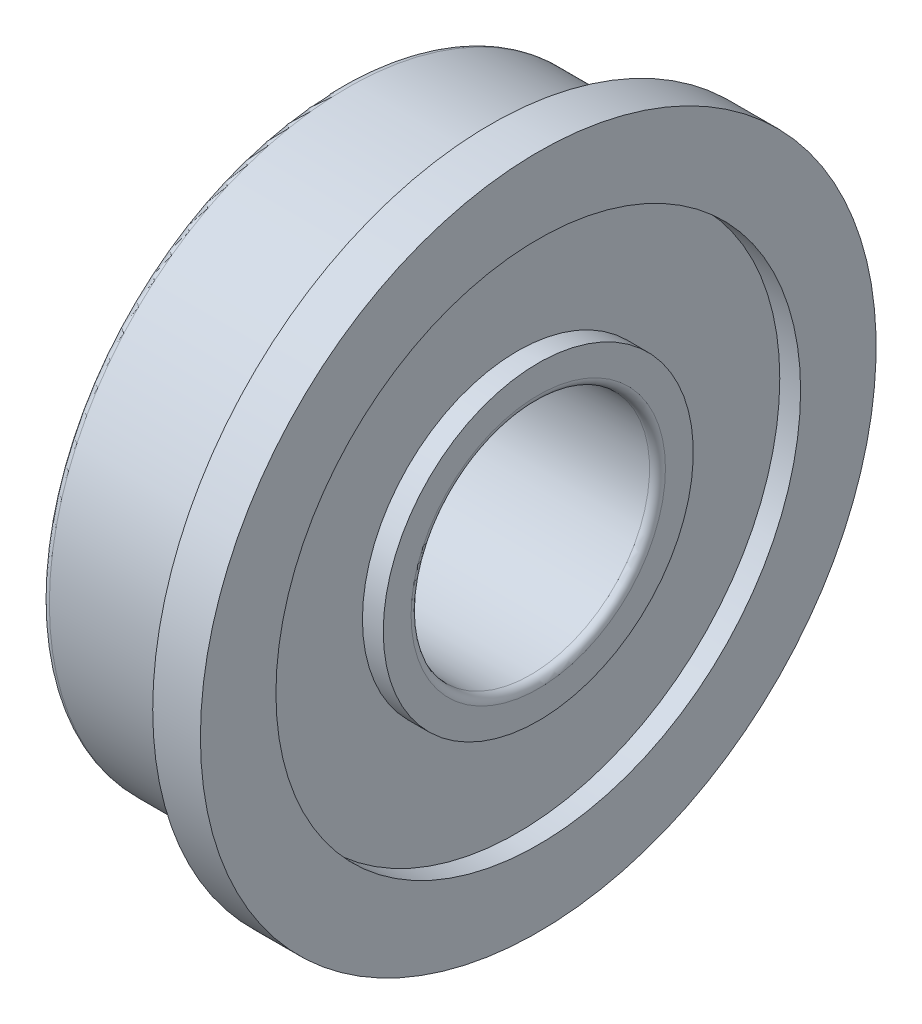
ISO-10303-21;
HEADER;
FILE_DESCRIPTION(('STEP AP214'),'2;1');
FILE_NAME('part.step','',(''),(''),'','','');
FILE_SCHEMA(('AUTOMOTIVE_DESIGN { 1 0 10303 214 1 1 1 1 }'));
ENDSEC;
DATA;
#1=APPLICATION_CONTEXT('core data for automotive mechanical design processes');
#2=APPLICATION_PROTOCOL_DEFINITION('international standard','automotive_design',2000,#1);
#3=PRODUCT_CONTEXT('',#1,'mechanical');
#4=PRODUCT('Part','Part','',(#3));
#5=PRODUCT_RELATED_PRODUCT_CATEGORY('part','',(#4));
#6=PRODUCT_DEFINITION_FORMATION('','',#4);
#7=PRODUCT_DEFINITION_CONTEXT('part definition',#1,'design');
#8=PRODUCT_DEFINITION('design','',#6,#7);
#9=PRODUCT_DEFINITION_SHAPE('','',#8);
#10=(LENGTH_UNIT() NAMED_UNIT(*) SI_UNIT(.MILLI.,.METRE.));
#11=(NAMED_UNIT(*) PLANE_ANGLE_UNIT() SI_UNIT($,.RADIAN.));
#12=(NAMED_UNIT(*) SI_UNIT($,.STERADIAN.) SOLID_ANGLE_UNIT());
#13=UNCERTAINTY_MEASURE_WITH_UNIT(LENGTH_MEASURE(1.E-05),#10,'distance_accuracy_value','');
#14=(GEOMETRIC_REPRESENTATION_CONTEXT(3) GLOBAL_UNCERTAINTY_ASSIGNED_CONTEXT((#13)) GLOBAL_UNIT_ASSIGNED_CONTEXT((#10,
#11,#12)) REPRESENTATION_CONTEXT('',''));
#15=CARTESIAN_POINT('',(0.,0.,0.));
#16=DIRECTION('',(0.,0.,1.));
#17=DIRECTION('',(1.,0.,0.));
#18=AXIS2_PLACEMENT_3D('',#15,#16,#17);
#19=CARTESIAN_POINT('',(0.,-3.90000000000003,-3.90000000000001));
#20=DIRECTION('',(-1.,0.,0.));
#21=DIRECTION('',(0.,0.,1.));
#22=AXIS2_PLACEMENT_3D('',#19,#20,#21);
#23=PLANE('',#22);
#24=CARTESIAN_POINT('',(0.,0.,0.));
#25=DIRECTION('',(-1.,0.,0.));
#26=DIRECTION('',(0.,0.,-1.));
#27=AXIS2_PLACEMENT_3D('',#24,#25,#26);
#28=CIRCLE('',#27,3.9);
#29=CARTESIAN_POINT('',(0.,0.,-3.9));
#30=VERTEX_POINT('',#29);
#31=EDGE_CURVE('E74',#30,#30,#28,.F.);
#32=ORIENTED_EDGE('',*,*,#31,.F.);
#33=EDGE_LOOP('',(#32));
#34=FACE_BOUND('',#33,.T.);
#35=CARTESIAN_POINT('',(0.,0.,0.));
#36=DIRECTION('',(1.,0.,0.));
#37=DIRECTION('',(0.,0.,1.));
#38=AXIS2_PLACEMENT_3D('',#35,#36,#37);
#39=CIRCLE('',#38,3.2);
#40=CARTESIAN_POINT('',(0.,0.,3.2));
#41=VERTEX_POINT('',#40);
#42=EDGE_CURVE('E71',#41,#41,#39,.T.);
#43=ORIENTED_EDGE('',*,*,#42,.T.);
#44=EDGE_LOOP('',(#43));
#45=FACE_BOUND('',#44,.T.);
#46=ADVANCED_FACE('F15',(#34,#45),#23,.T.);
#47=CARTESIAN_POINT('',(5.,-3.9,3.9));
#48=DIRECTION('',(1.,0.,0.));
#49=DIRECTION('',(0.,0.,-1.));
#50=AXIS2_PLACEMENT_3D('',#47,#48,#49);
#51=PLANE('',#50);
#52=CARTESIAN_POINT('',(5.,0.,0.));
#53=DIRECTION('',(1.,0.,0.));
#54=DIRECTION('',(0.,0.,1.));
#55=AXIS2_PLACEMENT_3D('',#52,#53,#54);
#56=CIRCLE('',#55,3.9);
#57=CARTESIAN_POINT('',(5.,0.,3.9));
#58=VERTEX_POINT('',#57);
#59=EDGE_CURVE('E68',#58,#58,#56,.T.);
#60=ORIENTED_EDGE('',*,*,#59,.T.);
#61=EDGE_LOOP('',(#60));
#62=FACE_BOUND('',#61,.T.);
#63=CARTESIAN_POINT('',(5.,0.,0.));
#64=DIRECTION('',(-1.,0.,0.));
#65=DIRECTION('',(0.,0.,-1.));
#66=AXIS2_PLACEMENT_3D('',#63,#64,#65);
#67=CIRCLE('',#66,3.2000001119473);
#68=CARTESIAN_POINT('',(5.,0.,-3.2000001119473));
#69=VERTEX_POINT('',#68);
#70=EDGE_CURVE('E65',#69,#69,#67,.F.);
#71=ORIENTED_EDGE('',*,*,#70,.F.);
#72=EDGE_LOOP('',(#71));
#73=FACE_BOUND('',#72,.T.);
#74=ADVANCED_FACE('F82',(#62,#73),#51,.T.);
#75=CARTESIAN_POINT('',(4.47625,-6.78033812054813,6.6));
#76=DIRECTION('',(1.,0.,0.));
#77=DIRECTION('',(0.,0.,-1.));
#78=AXIS2_PLACEMENT_3D('',#75,#76,#77);
#79=PLANE('',#78);
#80=CARTESIAN_POINT('',(4.47625,0.,0.));
#81=DIRECTION('',(1.,0.,0.));
#82=DIRECTION('',(0.,0.,1.));
#83=AXIS2_PLACEMENT_3D('',#80,#81,#82);
#84=CIRCLE('',#83,6.6);
#85=CARTESIAN_POINT('',(4.47625,0.,6.6));
#86=VERTEX_POINT('',#85);
#87=EDGE_CURVE('E62',#86,#86,#84,.T.);
#88=ORIENTED_EDGE('',*,*,#87,.T.);
#89=EDGE_LOOP('',(#88));
#90=FACE_BOUND('',#89,.T.);
#91=CARTESIAN_POINT('',(4.47625,0.,0.));
#92=DIRECTION('',(-1.,0.,0.));
#93=DIRECTION('',(0.,0.,-1.));
#94=AXIS2_PLACEMENT_3D('',#91,#92,#93);
#95=CIRCLE('',#94,3.9);
#96=CARTESIAN_POINT('',(4.47625,0.,-3.9));
#97=VERTEX_POINT('',#96);
#98=EDGE_CURVE('E59',#97,#97,#95,.F.);
#99=ORIENTED_EDGE('',*,*,#98,.F.);
#100=EDGE_LOOP('',(#99));
#101=FACE_BOUND('',#100,.T.);
#102=ADVANCED_FACE('F153',(#90,#101),#79,.T.);
#103=CARTESIAN_POINT('',(5.,-8.73225362560405,8.5));
#104=DIRECTION('',(1.,0.,0.));
#105=DIRECTION('',(0.,0.,-1.));
#106=AXIS2_PLACEMENT_3D('',#103,#104,#105);
#107=PLANE('',#106);
#108=CARTESIAN_POINT('',(5.,0.,0.));
#109=DIRECTION('',(1.,0.,0.));
#110=DIRECTION('',(0.,-1.16842149027969E-09,1.));
#111=AXIS2_PLACEMENT_3D('',#108,#109,#110);
#112=CIRCLE('',#111,8.5);
#113=CARTESIAN_POINT('',(5.,-9.93158266737737E-09,8.5));
#114=VERTEX_POINT('',#113);
#115=EDGE_CURVE('E56',#114,#114,#112,.T.);
#116=ORIENTED_EDGE('',*,*,#115,.T.);
#117=EDGE_LOOP('',(#116));
#118=FACE_BOUND('',#117,.T.);
#119=CARTESIAN_POINT('',(5.,0.,0.));
#120=DIRECTION('',(-1.,0.,0.));
#121=DIRECTION('',(0.,0.,-1.));
#122=AXIS2_PLACEMENT_3D('',#119,#120,#121);
#123=CIRCLE('',#122,6.6);
#124=CARTESIAN_POINT('',(5.,0.,-6.6));
#125=VERTEX_POINT('',#124);
#126=EDGE_CURVE('E53',#125,#125,#123,.F.);
#127=ORIENTED_EDGE('',*,*,#126,.F.);
#128=EDGE_LOOP('',(#127));
#129=FACE_BOUND('',#128,.T.);
#130=ADVANCED_FACE('F146',(#118,#129),#107,.T.);
#131=CARTESIAN_POINT('',(3.8,-8.73225364009987,-8.5));
#132=DIRECTION('',(-1.,0.,0.));
#133=DIRECTION('',(0.,0.,1.));
#134=AXIS2_PLACEMENT_3D('',#131,#132,#133);
#135=PLANE('',#134);
#136=CARTESIAN_POINT('',(3.8,0.,0.));
#137=DIRECTION('',(-1.,0.,0.));
#138=DIRECTION('',(0.,0.,-1.));
#139=AXIS2_PLACEMENT_3D('',#136,#137,#138);
#140=CIRCLE('',#139,8.5);
#141=CARTESIAN_POINT('',(3.8,0.,-8.5));
#142=VERTEX_POINT('',#141);
#143=EDGE_CURVE('E50',#142,#142,#140,.F.);
#144=ORIENTED_EDGE('',*,*,#143,.F.);
#145=EDGE_LOOP('',(#144));
#146=FACE_BOUND('',#145,.T.);
#147=CARTESIAN_POINT('',(3.8,0.,0.));
#148=DIRECTION('',(1.,0.,0.));
#149=DIRECTION('',(0.,0.,1.));
#150=AXIS2_PLACEMENT_3D('',#147,#148,#149);
#151=CIRCLE('',#150,7.7);
#152=CARTESIAN_POINT('',(3.8,0.,7.7));
#153=VERTEX_POINT('',#152);
#154=EDGE_CURVE('E47',#153,#153,#151,.T.);
#155=ORIENTED_EDGE('',*,*,#154,.T.);
#156=EDGE_LOOP('',(#155));
#157=FACE_BOUND('',#156,.T.);
#158=ADVANCED_FACE('F141',(#146,#157),#135,.T.);
#159=CARTESIAN_POINT('',(0.,-7.4994648909093,-7.3));
#160=DIRECTION('',(-1.,0.,0.));
#161=DIRECTION('',(0.,0.,1.));
#162=AXIS2_PLACEMENT_3D('',#159,#160,#161);
#163=PLANE('',#162);
#164=CARTESIAN_POINT('',(0.,0.,0.));
#165=DIRECTION('',(-1.,0.,0.));
#166=DIRECTION('',(0.,0.,-1.));
#167=AXIS2_PLACEMENT_3D('',#164,#165,#166);
#168=CIRCLE('',#167,7.3);
#169=CARTESIAN_POINT('',(0.,0.,-7.3));
#170=VERTEX_POINT('',#169);
#171=EDGE_CURVE('E44',#170,#170,#168,.F.);
#172=ORIENTED_EDGE('',*,*,#171,.F.);
#173=EDGE_LOOP('',(#172));
#174=FACE_BOUND('',#173,.T.);
#175=CARTESIAN_POINT('',(0.,0.,0.));
#176=DIRECTION('',(1.,0.,0.));
#177=DIRECTION('',(0.,0.,1.));
#178=AXIS2_PLACEMENT_3D('',#175,#176,#177);
#179=CIRCLE('',#178,6.6);
#180=CARTESIAN_POINT('',(0.,0.,6.6));
#181=VERTEX_POINT('',#180);
#182=EDGE_CURVE('E41',#181,#181,#179,.T.);
#183=ORIENTED_EDGE('',*,*,#182,.T.);
#184=EDGE_LOOP('',(#183));
#185=FACE_BOUND('',#184,.T.);
#186=ADVANCED_FACE('F100',(#174,#185),#163,.T.);
#187=CARTESIAN_POINT('',(0.52375,-6.78033812054813,-6.6));
#188=DIRECTION('',(-1.,0.,0.));
#189=DIRECTION('',(0.,0.,1.));
#190=AXIS2_PLACEMENT_3D('',#187,#188,#189);
#191=PLANE('',#190);
#192=CARTESIAN_POINT('',(0.52375,0.,0.));
#193=DIRECTION('',(-1.,0.,0.));
#194=DIRECTION('',(0.,0.,-1.));
#195=AXIS2_PLACEMENT_3D('',#192,#193,#194);
#196=CIRCLE('',#195,6.6);
#197=CARTESIAN_POINT('',(0.52375,0.,-6.6));
#198=VERTEX_POINT('',#197);
#199=EDGE_CURVE('E38',#198,#198,#196,.F.);
#200=ORIENTED_EDGE('',*,*,#199,.F.);
#201=EDGE_LOOP('',(#200));
#202=FACE_BOUND('',#201,.T.);
#203=CARTESIAN_POINT('',(0.52375,0.,0.));
#204=DIRECTION('',(1.,0.,0.));
#205=DIRECTION('',(0.,-1.42053902544095E-07,0.99999999999999));
#206=AXIS2_PLACEMENT_3D('',#203,#204,#205);
#207=CIRCLE('',#206,3.9);
#208=CARTESIAN_POINT('',(0.52375,-5.54010219921971E-07,3.89999999999996));
#209=VERTEX_POINT('',#208);
#210=EDGE_CURVE('E35',#209,#209,#207,.T.);
#211=ORIENTED_EDGE('',*,*,#210,.T.);
#212=EDGE_LOOP('',(#211));
#213=FACE_BOUND('',#212,.T.);
#214=ADVANCED_FACE('F89',(#202,#213),#191,.T.);
#215=CARTESIAN_POINT('',(0.200000000000016,0.,0.));
#216=DIRECTION('',(1.,0.,0.));
#217=DIRECTION('',(0.,0.,1.));
#218=AXIS2_PLACEMENT_3D('',#215,#216,#217);
#219=TOROIDAL_SURFACE('',#218,3.2,0.200000000000016);
#220=CARTESIAN_POINT('',(0.2,0.,0.));
#221=DIRECTION('',(1.,0.,0.));
#222=DIRECTION('',(0.,0.,1.));
#223=AXIS2_PLACEMENT_3D('',#220,#221,#222);
#224=CIRCLE('',#223,2.99999999999998);
#225=CARTESIAN_POINT('',(0.2,0.,2.99999999999998));
#226=VERTEX_POINT('',#225);
#227=EDGE_CURVE('E30',#226,#226,#224,.T.);
#228=ORIENTED_EDGE('',*,*,#227,.T.);
#229=EDGE_LOOP('',(#228));
#230=FACE_BOUND('',#229,.T.);
#231=ORIENTED_EDGE('',*,*,#42,.F.);
#232=EDGE_LOOP('',(#231));
#233=FACE_BOUND('',#232,.T.);
#234=ADVANCED_FACE('F86',(#230,#233),#219,.T.);
#235=CARTESIAN_POINT('',(15.,0.,0.));
#236=DIRECTION('',(1.,0.,0.));
#237=DIRECTION('',(0.,0.,1.));
#238=AXIS2_PLACEMENT_3D('',#235,#236,#237);
#239=CYLINDRICAL_SURFACE('',#238,3.);
#240=CARTESIAN_POINT('',(4.8,0.,0.));
#241=DIRECTION('',(1.,0.,0.));
#242=DIRECTION('',(0.,0.,1.));
#243=AXIS2_PLACEMENT_3D('',#240,#241,#242);
#244=CIRCLE('',#243,3.);
#245=CARTESIAN_POINT('',(4.8,0.,3.));
#246=VERTEX_POINT('',#245);
#247=EDGE_CURVE('E26',#246,#246,#244,.T.);
#248=ORIENTED_EDGE('',*,*,#247,.T.);
#249=EDGE_LOOP('',(#248));
#250=FACE_BOUND('',#249,.T.);
#251=ORIENTED_EDGE('',*,*,#227,.F.);
#252=EDGE_LOOP('',(#251));
#253=FACE_BOUND('',#252,.T.);
#254=ADVANCED_FACE('F88',(#250,#253),#239,.F.);
#255=CARTESIAN_POINT('',(4.8,0.,0.));
#256=DIRECTION('',(1.,0.,0.));
#257=DIRECTION('',(0.,0.,1.));
#258=AXIS2_PLACEMENT_3D('',#255,#256,#257);
#259=TOROIDAL_SURFACE('',#258,3.2,0.200000000000032);
#260=ORIENTED_EDGE('',*,*,#70,.T.);
#261=EDGE_LOOP('',(#260));
#262=FACE_BOUND('',#261,.T.);
#263=ORIENTED_EDGE('',*,*,#247,.F.);
#264=EDGE_LOOP('',(#263));
#265=FACE_BOUND('',#264,.T.);
#266=ADVANCED_FACE('F97',(#262,#265),#259,.T.);
#267=CARTESIAN_POINT('',(15.,0.,0.));
#268=DIRECTION('',(1.,0.,0.));
#269=DIRECTION('',(0.,1.4205390342948E-07,0.99999999999999));
#270=AXIS2_PLACEMENT_3D('',#267,#268,#269);
#271=CYLINDRICAL_SURFACE('',#270,3.9);
#272=ORIENTED_EDGE('',*,*,#98,.T.);
#273=EDGE_LOOP('',(#272));
#274=FACE_BOUND('',#273,.T.);
#275=ORIENTED_EDGE('',*,*,#59,.F.);
#276=EDGE_LOOP('',(#275));
#277=FACE_BOUND('',#276,.T.);
#278=ADVANCED_FACE('F107',(#274,#277),#271,.T.);
#279=CARTESIAN_POINT('',(15.,0.,0.));
#280=DIRECTION('',(1.,0.,0.));
#281=DIRECTION('',(0.,0.,1.));
#282=AXIS2_PLACEMENT_3D('',#279,#280,#281);
#283=CYLINDRICAL_SURFACE('',#282,6.6);
#284=ORIENTED_EDGE('',*,*,#126,.T.);
#285=EDGE_LOOP('',(#284));
#286=FACE_BOUND('',#285,.T.);
#287=ORIENTED_EDGE('',*,*,#87,.F.);
#288=EDGE_LOOP('',(#287));
#289=FACE_BOUND('',#288,.T.);
#290=ADVANCED_FACE('F111',(#286,#289),#283,.F.);
#291=CARTESIAN_POINT('',(15.,0.,0.));
#292=DIRECTION('',(1.,0.,0.));
#293=DIRECTION('',(0.,0.,1.));
#294=AXIS2_PLACEMENT_3D('',#291,#292,#293);
#295=CYLINDRICAL_SURFACE('',#294,8.5);
#296=ORIENTED_EDGE('',*,*,#143,.T.);
#297=EDGE_LOOP('',(#296));
#298=FACE_BOUND('',#297,.T.);
#299=ORIENTED_EDGE('',*,*,#115,.F.);
#300=EDGE_LOOP('',(#299));
#301=FACE_BOUND('',#300,.T.);
#302=ADVANCED_FACE('F115',(#298,#301),#295,.T.);
#303=CARTESIAN_POINT('',(3.8,0.,0.));
#304=DIRECTION('',(1.,0.,0.));
#305=DIRECTION('',(0.,0.,1.));
#306=AXIS2_PLACEMENT_3D('',#303,#304,#305);
#307=TOROIDAL_SURFACE('',#306,7.5,0.199999999999996);
#308=ORIENTED_EDGE('',*,*,#154,.F.);
#309=EDGE_LOOP('',(#308));
#310=FACE_BOUND('',#309,.T.);
#311=CARTESIAN_POINT('',(3.6,0.,0.));
#312=DIRECTION('',(1.,0.,0.));
#313=DIRECTION('',(0.,0.,1.));
#314=AXIS2_PLACEMENT_3D('',#311,#312,#313);
#315=CIRCLE('',#314,7.5);
#316=CARTESIAN_POINT('',(3.6,0.,7.5));
#317=VERTEX_POINT('',#316);
#318=EDGE_CURVE('E22',#317,#317,#315,.T.);
#319=ORIENTED_EDGE('',*,*,#318,.T.);
#320=EDGE_LOOP('',(#319));
#321=FACE_BOUND('',#320,.T.);
#322=ADVANCED_FACE('F119',(#310,#321),#307,.F.);
#323=CARTESIAN_POINT('',(15.,0.,0.));
#324=DIRECTION('',(1.,0.,0.));
#325=DIRECTION('',(0.,0.,1.));
#326=AXIS2_PLACEMENT_3D('',#323,#324,#325);
#327=CYLINDRICAL_SURFACE('',#326,7.5);
#328=CARTESIAN_POINT('',(0.200000000000008,0.,0.));
#329=DIRECTION('',(1.,0.,0.));
#330=DIRECTION('',(0.,-1.9234201974874E-10,1.));
#331=AXIS2_PLACEMENT_3D('',#328,#329,#330);
#332=CIRCLE('',#331,7.5);
#333=CARTESIAN_POINT('',(0.200000000000008,-1.44256514811555E-09,7.5));
#334=VERTEX_POINT('',#333);
#335=EDGE_CURVE('E10',#334,#334,#332,.T.);
#336=ORIENTED_EDGE('',*,*,#335,.T.);
#337=EDGE_LOOP('',(#336));
#338=FACE_BOUND('',#337,.T.);
#339=ORIENTED_EDGE('',*,*,#318,.F.);
#340=EDGE_LOOP('',(#339));
#341=FACE_BOUND('',#340,.T.);
#342=ADVANCED_FACE('F123',(#338,#341),#327,.T.);
#343=CARTESIAN_POINT('',(0.200000000000016,0.,0.));
#344=DIRECTION('',(1.,0.,0.));
#345=DIRECTION('',(0.,0.,1.));
#346=AXIS2_PLACEMENT_3D('',#343,#344,#345);
#347=TOROIDAL_SURFACE('',#346,7.3,0.200000000000016);
#348=ORIENTED_EDGE('',*,*,#171,.T.);
#349=EDGE_LOOP('',(#348));
#350=FACE_BOUND('',#349,.T.);
#351=ORIENTED_EDGE('',*,*,#335,.F.);
#352=EDGE_LOOP('',(#351));
#353=FACE_BOUND('',#352,.T.);
#354=ADVANCED_FACE('F127',(#350,#353),#347,.T.);
#355=CARTESIAN_POINT('',(15.,0.,0.));
#356=DIRECTION('',(1.,0.,0.));
#357=DIRECTION('',(0.,0.,1.));
#358=AXIS2_PLACEMENT_3D('',#355,#356,#357);
#359=CYLINDRICAL_SURFACE('',#358,6.6);
#360=ORIENTED_EDGE('',*,*,#199,.T.);
#361=EDGE_LOOP('',(#360));
#362=FACE_BOUND('',#361,.T.);
#363=ORIENTED_EDGE('',*,*,#182,.F.);
#364=EDGE_LOOP('',(#363));
#365=FACE_BOUND('',#364,.T.);
#366=ADVANCED_FACE('F129',(#362,#365),#359,.F.);
#367=CARTESIAN_POINT('',(15.,0.,0.));
#368=DIRECTION('',(1.,0.,0.));
#369=DIRECTION('',(0.,1.41721902336196E-07,0.99999999999999));
#370=AXIS2_PLACEMENT_3D('',#367,#368,#369);
#371=CYLINDRICAL_SURFACE('',#370,3.9);
#372=ORIENTED_EDGE('',*,*,#31,.T.);
#373=EDGE_LOOP('',(#372));
#374=FACE_BOUND('',#373,.T.);
#375=ORIENTED_EDGE('',*,*,#210,.F.);
#376=EDGE_LOOP('',(#375));
#377=FACE_BOUND('',#376,.T.);
#378=ADVANCED_FACE('F17',(#374,#377),#371,.T.);
#379=CLOSED_SHELL('',(#46,#74,#102,#130,#158,#186,#214,#234,#254,#266,#278,#290,#302,#322,#342,
#354,#366,#378));
#380=MANIFOLD_SOLID_BREP('B1',#379);
#381=ADVANCED_BREP_SHAPE_REPRESENTATION('',(#18,#380),#14);
#382=SHAPE_DEFINITION_REPRESENTATION(#9,#381);
ENDSEC;
END-ISO-10303-21;
